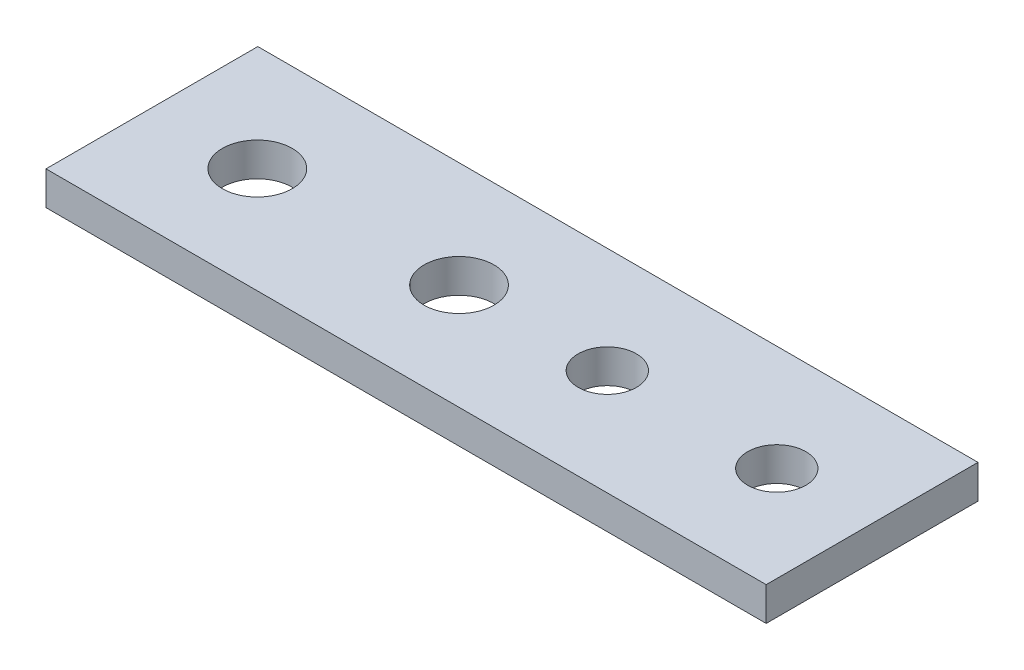
ISO-10303-21;
HEADER;
FILE_DESCRIPTION(('STEP AP214'),'2;1');
FILE_NAME('part.step','',(''),(''),'','','');
FILE_SCHEMA(('AUTOMOTIVE_DESIGN { 1 0 10303 214 1 1 1 1 }'));
ENDSEC;
DATA;
#1=APPLICATION_CONTEXT('core data for automotive mechanical design processes');
#2=APPLICATION_PROTOCOL_DEFINITION('international standard','automotive_design',2000,#1);
#3=PRODUCT_CONTEXT('',#1,'mechanical');
#4=PRODUCT('Part','Part','',(#3));
#5=PRODUCT_RELATED_PRODUCT_CATEGORY('part','',(#4));
#6=PRODUCT_DEFINITION_FORMATION('','',#4);
#7=PRODUCT_DEFINITION_CONTEXT('part definition',#1,'design');
#8=PRODUCT_DEFINITION('design','',#6,#7);
#9=PRODUCT_DEFINITION_SHAPE('','',#8);
#10=(LENGTH_UNIT() NAMED_UNIT(*) SI_UNIT(.MILLI.,.METRE.));
#11=(NAMED_UNIT(*) PLANE_ANGLE_UNIT() SI_UNIT($,.RADIAN.));
#12=(NAMED_UNIT(*) SI_UNIT($,.STERADIAN.) SOLID_ANGLE_UNIT());
#13=UNCERTAINTY_MEASURE_WITH_UNIT(LENGTH_MEASURE(1.E-05),#10,'distance_accuracy_value','');
#14=(GEOMETRIC_REPRESENTATION_CONTEXT(3) GLOBAL_UNCERTAINTY_ASSIGNED_CONTEXT((#13)) GLOBAL_UNIT_ASSIGNED_CONTEXT((#10,
#11,#12)) REPRESENTATION_CONTEXT('',''));
#15=CARTESIAN_POINT('',(0.,0.,0.));
#16=DIRECTION('',(0.,0.,1.));
#17=DIRECTION('',(1.,0.,0.));
#18=AXIS2_PLACEMENT_3D('',#15,#16,#17);
#19=CARTESIAN_POINT('',(0.,3.175,0.));
#20=DIRECTION('',(-1.,0.,0.));
#21=DIRECTION('',(0.,0.,1.));
#22=AXIS2_PLACEMENT_3D('',#19,#20,#21);
#23=PLANE('',#22);
#24=DIRECTION('',(0.,0.,-1.));
#25=VECTOR('',#24,1.);
#26=CARTESIAN_POINT('',(0.,0.,0.));
#27=LINE('',#26,#25);
#28=CARTESIAN_POINT('',(0.,0.,0.));
#29=VERTEX_POINT('',#28);
#30=CARTESIAN_POINT('',(0.,0.,-20.));
#31=VERTEX_POINT('',#30);
#32=EDGE_CURVE('E110',#29,#31,#27,.T.);
#33=ORIENTED_EDGE('',*,*,#32,.T.);
#34=DIRECTION('',(0.,-1.,0.));
#35=VECTOR('',#34,1.);
#36=CARTESIAN_POINT('',(0.,3.175,-20.));
#37=LINE('',#36,#35);
#38=CARTESIAN_POINT('',(0.,3.175,-20.));
#39=VERTEX_POINT('',#38);
#40=EDGE_CURVE('E11',#39,#31,#37,.T.);
#41=ORIENTED_EDGE('',*,*,#40,.F.);
#42=DIRECTION('',(0.,0.,-1.));
#43=VECTOR('',#42,1.);
#44=CARTESIAN_POINT('',(0.,3.175,0.));
#45=LINE('',#44,#43);
#46=CARTESIAN_POINT('',(0.,3.175,0.));
#47=VERTEX_POINT('',#46);
#48=EDGE_CURVE('E93',#47,#39,#45,.T.);
#49=ORIENTED_EDGE('',*,*,#48,.F.);
#50=DIRECTION('',(0.,-1.,0.));
#51=VECTOR('',#50,1.);
#52=CARTESIAN_POINT('',(0.,3.175,0.));
#53=LINE('',#52,#51);
#54=EDGE_CURVE('E106',#47,#29,#53,.T.);
#55=ORIENTED_EDGE('',*,*,#54,.T.);
#56=EDGE_LOOP('',(#33,#41,#49,#55));
#57=FACE_BOUND('',#56,.T.);
#58=ADVANCED_FACE('F39',(#57),#23,.F.);
#59=CARTESIAN_POINT('',(0.,3.175,-20.));
#60=DIRECTION('',(0.,0.,1.));
#61=DIRECTION('',(1.,0.,0.));
#62=AXIS2_PLACEMENT_3D('',#59,#60,#61);
#63=PLANE('',#62);
#64=DIRECTION('',(-1.,0.,0.));
#65=VECTOR('',#64,1.);
#66=CARTESIAN_POINT('',(0.,0.,-20.));
#67=LINE('',#66,#65);
#68=CARTESIAN_POINT('',(-68.,0.,-20.));
#69=VERTEX_POINT('',#68);
#70=EDGE_CURVE('E98',#31,#69,#67,.T.);
#71=ORIENTED_EDGE('',*,*,#70,.T.);
#72=DIRECTION('',(0.,-1.,0.));
#73=VECTOR('',#72,1.);
#74=CARTESIAN_POINT('',(-68.,3.175,-20.));
#75=LINE('',#74,#73);
#76=CARTESIAN_POINT('',(-68.,3.175,-20.));
#77=VERTEX_POINT('',#76);
#78=EDGE_CURVE('E49',#77,#69,#75,.T.);
#79=ORIENTED_EDGE('',*,*,#78,.F.);
#80=DIRECTION('',(-1.,0.,0.));
#81=VECTOR('',#80,1.);
#82=CARTESIAN_POINT('',(0.,3.175,-20.));
#83=LINE('',#82,#81);
#84=EDGE_CURVE('E88',#39,#77,#83,.T.);
#85=ORIENTED_EDGE('',*,*,#84,.F.);
#86=ORIENTED_EDGE('',*,*,#40,.T.);
#87=EDGE_LOOP('',(#71,#79,#85,#86));
#88=FACE_BOUND('',#87,.T.);
#89=ADVANCED_FACE('F97',(#88),#63,.F.);
#90=CARTESIAN_POINT('',(-68.,3.175,0.));
#91=DIRECTION('',(1.,0.,0.));
#92=DIRECTION('',(0.,0.,-1.));
#93=AXIS2_PLACEMENT_3D('',#90,#91,#92);
#94=PLANE('',#93);
#95=DIRECTION('',(0.,0.,1.));
#96=VECTOR('',#95,1.);
#97=CARTESIAN_POINT('',(-68.,0.,0.));
#98=LINE('',#97,#96);
#99=CARTESIAN_POINT('',(-68.,0.,0.));
#100=VERTEX_POINT('',#99);
#101=EDGE_CURVE('E75',#69,#100,#98,.T.);
#102=ORIENTED_EDGE('',*,*,#101,.T.);
#103=DIRECTION('',(0.,-1.,0.));
#104=VECTOR('',#103,1.);
#105=CARTESIAN_POINT('',(-68.,3.175,0.));
#106=LINE('',#105,#104);
#107=CARTESIAN_POINT('',(-68.,3.175,0.));
#108=VERTEX_POINT('',#107);
#109=EDGE_CURVE('E100',#108,#100,#106,.T.);
#110=ORIENTED_EDGE('',*,*,#109,.F.);
#111=DIRECTION('',(0.,0.,1.));
#112=VECTOR('',#111,1.);
#113=CARTESIAN_POINT('',(-68.,3.175,0.));
#114=LINE('',#113,#112);
#115=EDGE_CURVE('E91',#77,#108,#114,.T.);
#116=ORIENTED_EDGE('',*,*,#115,.F.);
#117=ORIENTED_EDGE('',*,*,#78,.T.);
#118=EDGE_LOOP('',(#102,#110,#116,#117));
#119=FACE_BOUND('',#118,.T.);
#120=ADVANCED_FACE('F102',(#119),#94,.F.);
#121=CARTESIAN_POINT('',(0.,3.175,0.));
#122=DIRECTION('',(0.,0.,-1.));
#123=DIRECTION('',(-1.,0.,0.));
#124=AXIS2_PLACEMENT_3D('',#121,#122,#123);
#125=PLANE('',#124);
#126=DIRECTION('',(1.,0.,0.));
#127=VECTOR('',#126,1.);
#128=CARTESIAN_POINT('',(0.,0.,0.));
#129=LINE('',#128,#127);
#130=EDGE_CURVE('E81',#100,#29,#129,.T.);
#131=ORIENTED_EDGE('',*,*,#130,.T.);
#132=ORIENTED_EDGE('',*,*,#54,.F.);
#133=DIRECTION('',(1.,0.,0.));
#134=VECTOR('',#133,1.);
#135=CARTESIAN_POINT('',(0.,3.175,0.));
#136=LINE('',#135,#134);
#137=EDGE_CURVE('E58',#108,#47,#136,.T.);
#138=ORIENTED_EDGE('',*,*,#137,.F.);
#139=ORIENTED_EDGE('',*,*,#109,.T.);
#140=EDGE_LOOP('',(#131,#132,#138,#139));
#141=FACE_BOUND('',#140,.T.);
#142=ADVANCED_FACE('F165',(#141),#125,.F.);
#143=CARTESIAN_POINT('',(0.,3.175,0.));
#144=DIRECTION('',(0.,1.,0.));
#145=DIRECTION('',(0.,0.,1.));
#146=AXIS2_PLACEMENT_3D('',#143,#144,#145);
#147=PLANE('',#146);
#148=CARTESIAN_POINT('',(-25.,3.175,-10.));
#149=DIRECTION('',(0.,1.,0.));
#150=DIRECTION('',(0.,0.,1.));
#151=AXIS2_PLACEMENT_3D('',#148,#149,#150);
#152=CIRCLE('',#151,2.75);
#153=CARTESIAN_POINT('',(-25.,3.175,-7.25));
#154=VERTEX_POINT('',#153);
#155=EDGE_CURVE('E154',#154,#154,#152,.T.);
#156=ORIENTED_EDGE('',*,*,#155,.F.);
#157=EDGE_LOOP('',(#156));
#158=FACE_BOUND('',#157,.T.);
#159=CARTESIAN_POINT('',(-9.,3.175,-10.));
#160=DIRECTION('',(0.,1.,0.));
#161=DIRECTION('',(0.,0.,1.));
#162=AXIS2_PLACEMENT_3D('',#159,#160,#161);
#163=CIRCLE('',#162,2.75);
#164=CARTESIAN_POINT('',(-9.,3.175,-7.25));
#165=VERTEX_POINT('',#164);
#166=EDGE_CURVE('E146',#165,#165,#163,.T.);
#167=ORIENTED_EDGE('',*,*,#166,.F.);
#168=EDGE_LOOP('',(#167));
#169=FACE_BOUND('',#168,.T.);
#170=CARTESIAN_POINT('',(-39.,3.175,-10.));
#171=DIRECTION('',(0.,1.,0.));
#172=DIRECTION('',(0.,0.,1.));
#173=AXIS2_PLACEMENT_3D('',#170,#171,#172);
#174=CIRCLE('',#173,3.3);
#175=CARTESIAN_POINT('',(-39.,3.175,-6.7));
#176=VERTEX_POINT('',#175);
#177=EDGE_CURVE('E136',#176,#176,#174,.T.);
#178=ORIENTED_EDGE('',*,*,#177,.F.);
#179=EDGE_LOOP('',(#178));
#180=FACE_BOUND('',#179,.T.);
#181=CARTESIAN_POINT('',(-58.05,3.175,-10.));
#182=DIRECTION('',(0.,1.,0.));
#183=DIRECTION('',(0.,0.,1.));
#184=AXIS2_PLACEMENT_3D('',#181,#182,#183);
#185=CIRCLE('',#184,3.3);
#186=CARTESIAN_POINT('',(-58.05,3.175,-6.7));
#187=VERTEX_POINT('',#186);
#188=EDGE_CURVE('E126',#187,#187,#185,.T.);
#189=ORIENTED_EDGE('',*,*,#188,.F.);
#190=EDGE_LOOP('',(#189));
#191=FACE_BOUND('',#190,.T.);
#192=ORIENTED_EDGE('',*,*,#48,.T.);
#193=ORIENTED_EDGE('',*,*,#84,.T.);
#194=ORIENTED_EDGE('',*,*,#115,.T.);
#195=ORIENTED_EDGE('',*,*,#137,.T.);
#196=EDGE_LOOP('',(#192,#193,#194,#195));
#197=FACE_BOUND('',#196,.T.);
#198=ADVANCED_FACE('F89',(#158,#169,#180,#191,#197),#147,.T.);
#199=CARTESIAN_POINT('',(0.,0.,0.));
#200=DIRECTION('',(0.,1.,0.));
#201=DIRECTION('',(0.,0.,1.));
#202=AXIS2_PLACEMENT_3D('',#199,#200,#201);
#203=PLANE('',#202);
#204=CARTESIAN_POINT('',(-25.,0.,-10.));
#205=DIRECTION('',(0.,1.,0.));
#206=DIRECTION('',(0.,0.,1.));
#207=AXIS2_PLACEMENT_3D('',#204,#205,#206);
#208=CIRCLE('',#207,2.75);
#209=CARTESIAN_POINT('',(-25.,0.,-7.25));
#210=VERTEX_POINT('',#209);
#211=EDGE_CURVE('E150',#210,#210,#208,.T.);
#212=ORIENTED_EDGE('',*,*,#211,.T.);
#213=EDGE_LOOP('',(#212));
#214=FACE_BOUND('',#213,.T.);
#215=CARTESIAN_POINT('',(-9.,0.,-10.));
#216=DIRECTION('',(0.,1.,0.));
#217=DIRECTION('',(0.,0.,1.));
#218=AXIS2_PLACEMENT_3D('',#215,#216,#217);
#219=CIRCLE('',#218,2.75);
#220=CARTESIAN_POINT('',(-9.,0.,-7.25));
#221=VERTEX_POINT('',#220);
#222=EDGE_CURVE('E142',#221,#221,#219,.T.);
#223=ORIENTED_EDGE('',*,*,#222,.T.);
#224=EDGE_LOOP('',(#223));
#225=FACE_BOUND('',#224,.T.);
#226=CARTESIAN_POINT('',(-39.,0.,-10.));
#227=DIRECTION('',(0.,1.,0.));
#228=DIRECTION('',(0.,0.,1.));
#229=AXIS2_PLACEMENT_3D('',#226,#227,#228);
#230=CIRCLE('',#229,3.3);
#231=CARTESIAN_POINT('',(-39.,0.,-6.7));
#232=VERTEX_POINT('',#231);
#233=EDGE_CURVE('E42',#232,#232,#230,.T.);
#234=ORIENTED_EDGE('',*,*,#233,.T.);
#235=EDGE_LOOP('',(#234));
#236=FACE_BOUND('',#235,.T.);
#237=CARTESIAN_POINT('',(-58.05,0.,-10.));
#238=DIRECTION('',(0.,1.,0.));
#239=DIRECTION('',(0.,0.,1.));
#240=AXIS2_PLACEMENT_3D('',#237,#238,#239);
#241=CIRCLE('',#240,3.3);
#242=CARTESIAN_POINT('',(-58.05,0.,-6.7));
#243=VERTEX_POINT('',#242);
#244=EDGE_CURVE('E114',#243,#243,#241,.T.);
#245=ORIENTED_EDGE('',*,*,#244,.T.);
#246=EDGE_LOOP('',(#245));
#247=FACE_BOUND('',#246,.T.);
#248=ORIENTED_EDGE('',*,*,#32,.F.);
#249=ORIENTED_EDGE('',*,*,#130,.F.);
#250=ORIENTED_EDGE('',*,*,#101,.F.);
#251=ORIENTED_EDGE('',*,*,#70,.F.);
#252=EDGE_LOOP('',(#248,#249,#250,#251));
#253=FACE_BOUND('',#252,.T.);
#254=ADVANCED_FACE('F164',(#214,#225,#236,#247,#253),#203,.F.);
#255=CARTESIAN_POINT('',(-58.05,3.175,-10.));
#256=DIRECTION('',(0.,1.,0.));
#257=DIRECTION('',(0.,0.,1.));
#258=AXIS2_PLACEMENT_3D('',#255,#256,#257);
#259=CYLINDRICAL_SURFACE('',#258,3.3);
#260=ORIENTED_EDGE('',*,*,#188,.T.);
#261=EDGE_LOOP('',(#260));
#262=FACE_BOUND('',#261,.T.);
#263=ORIENTED_EDGE('',*,*,#244,.F.);
#264=EDGE_LOOP('',(#263));
#265=FACE_BOUND('',#264,.T.);
#266=ADVANCED_FACE('F176',(#262,#265),#259,.F.);
#267=CARTESIAN_POINT('',(-39.,3.175,-10.));
#268=DIRECTION('',(0.,1.,0.));
#269=DIRECTION('',(0.,0.,1.));
#270=AXIS2_PLACEMENT_3D('',#267,#268,#269);
#271=CYLINDRICAL_SURFACE('',#270,3.3);
#272=ORIENTED_EDGE('',*,*,#177,.T.);
#273=EDGE_LOOP('',(#272));
#274=FACE_BOUND('',#273,.T.);
#275=ORIENTED_EDGE('',*,*,#233,.F.);
#276=EDGE_LOOP('',(#275));
#277=FACE_BOUND('',#276,.T.);
#278=ADVANCED_FACE('F172',(#274,#277),#271,.F.);
#279=CARTESIAN_POINT('',(-9.,3.175,-10.));
#280=DIRECTION('',(0.,1.,0.));
#281=DIRECTION('',(0.,0.,1.));
#282=AXIS2_PLACEMENT_3D('',#279,#280,#281);
#283=CYLINDRICAL_SURFACE('',#282,2.75);
#284=ORIENTED_EDGE('',*,*,#166,.T.);
#285=EDGE_LOOP('',(#284));
#286=FACE_BOUND('',#285,.T.);
#287=ORIENTED_EDGE('',*,*,#222,.F.);
#288=EDGE_LOOP('',(#287));
#289=FACE_BOUND('',#288,.T.);
#290=ADVANCED_FACE('F175',(#286,#289),#283,.F.);
#291=CARTESIAN_POINT('',(-25.,3.175,-10.));
#292=DIRECTION('',(0.,1.,0.));
#293=DIRECTION('',(0.,0.,1.));
#294=AXIS2_PLACEMENT_3D('',#291,#292,#293);
#295=CYLINDRICAL_SURFACE('',#294,2.75);
#296=ORIENTED_EDGE('',*,*,#155,.T.);
#297=EDGE_LOOP('',(#296));
#298=FACE_BOUND('',#297,.T.);
#299=ORIENTED_EDGE('',*,*,#211,.F.);
#300=EDGE_LOOP('',(#299));
#301=FACE_BOUND('',#300,.T.);
#302=ADVANCED_FACE('F159',(#298,#301),#295,.F.);
#303=CLOSED_SHELL('',(#58,#89,#120,#142,#198,#254,#266,#278,#290,#302));
#304=MANIFOLD_SOLID_BREP('B2',#303);
#305=ADVANCED_BREP_SHAPE_REPRESENTATION('',(#18,#304),#14);
#306=SHAPE_DEFINITION_REPRESENTATION(#9,#305);
ENDSEC;
END-ISO-10303-21;
